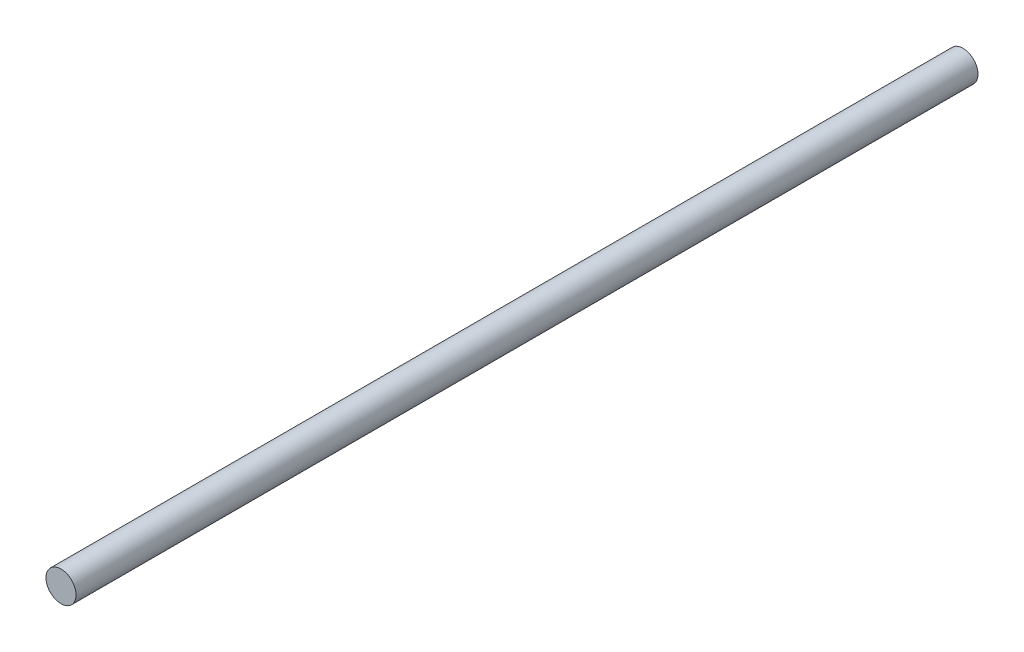
ISO-10303-21;
HEADER;
FILE_DESCRIPTION(('STEP AP214'),'2;1');
FILE_NAME('part.step','',(''),(''),'','','');
FILE_SCHEMA(('AUTOMOTIVE_DESIGN { 1 0 10303 214 1 1 1 1 }'));
ENDSEC;
DATA;
#1=APPLICATION_CONTEXT('core data for automotive mechanical design processes');
#2=APPLICATION_PROTOCOL_DEFINITION('international standard','automotive_design',2000,#1);
#3=PRODUCT_CONTEXT('',#1,'mechanical');
#4=PRODUCT('Part','Part','',(#3));
#5=PRODUCT_RELATED_PRODUCT_CATEGORY('part','',(#4));
#6=PRODUCT_DEFINITION_FORMATION('','',#4);
#7=PRODUCT_DEFINITION_CONTEXT('part definition',#1,'design');
#8=PRODUCT_DEFINITION('design','',#6,#7);
#9=PRODUCT_DEFINITION_SHAPE('','',#8);
#10=(LENGTH_UNIT() NAMED_UNIT(*) SI_UNIT(.MILLI.,.METRE.));
#11=(NAMED_UNIT(*) PLANE_ANGLE_UNIT() SI_UNIT($,.RADIAN.));
#12=(NAMED_UNIT(*) SI_UNIT($,.STERADIAN.) SOLID_ANGLE_UNIT());
#13=UNCERTAINTY_MEASURE_WITH_UNIT(LENGTH_MEASURE(1.E-05),#10,'distance_accuracy_value','');
#14=(GEOMETRIC_REPRESENTATION_CONTEXT(3) GLOBAL_UNCERTAINTY_ASSIGNED_CONTEXT((#13)) GLOBAL_UNIT_ASSIGNED_CONTEXT((#10,
#11,#12)) REPRESENTATION_CONTEXT('',''));
#15=CARTESIAN_POINT('',(0.,0.,0.));
#16=DIRECTION('',(0.,0.,1.));
#17=DIRECTION('',(1.,0.,0.));
#18=AXIS2_PLACEMENT_3D('',#15,#16,#17);
#19=CARTESIAN_POINT('',(0.,0.,180.));
#20=DIRECTION('',(0.,0.,-1.));
#21=DIRECTION('',(-1.,0.,0.));
#22=AXIS2_PLACEMENT_3D('',#19,#20,#21);
#23=CYLINDRICAL_SURFACE('',#22,3.);
#24=CARTESIAN_POINT('',(0.,0.,180.));
#25=DIRECTION('',(0.,0.,1.));
#26=DIRECTION('',(1.,0.,0.));
#27=AXIS2_PLACEMENT_3D('',#24,#25,#26);
#28=CIRCLE('',#27,3.);
#29=CARTESIAN_POINT('',(3.,0.,180.));
#30=VERTEX_POINT('',#29);
#31=EDGE_CURVE('E10',#30,#30,#28,.T.);
#32=ORIENTED_EDGE('',*,*,#31,.F.);
#33=EDGE_LOOP('',(#32));
#34=FACE_BOUND('',#33,.T.);
#35=CARTESIAN_POINT('',(0.,0.,0.));
#36=DIRECTION('',(0.,0.,1.));
#37=DIRECTION('',(1.,0.,0.));
#38=AXIS2_PLACEMENT_3D('',#35,#36,#37);
#39=CIRCLE('',#38,3.);
#40=CARTESIAN_POINT('',(3.,0.,0.));
#41=VERTEX_POINT('',#40);
#42=EDGE_CURVE('E35',#41,#41,#39,.T.);
#43=ORIENTED_EDGE('',*,*,#42,.T.);
#44=EDGE_LOOP('',(#43));
#45=FACE_BOUND('',#44,.T.);
#46=ADVANCED_FACE('F32',(#34,#45),#23,.T.);
#47=CARTESIAN_POINT('',(0.,0.,180.));
#48=DIRECTION('',(0.,0.,1.));
#49=DIRECTION('',(1.,0.,0.));
#50=AXIS2_PLACEMENT_3D('',#47,#48,#49);
#51=PLANE('',#50);
#52=ORIENTED_EDGE('',*,*,#31,.T.);
#53=EDGE_LOOP('',(#52));
#54=FACE_BOUND('',#53,.T.);
#55=ADVANCED_FACE('F47',(#54),#51,.T.);
#56=CARTESIAN_POINT('',(0.,0.,0.));
#57=DIRECTION('',(0.,0.,1.));
#58=DIRECTION('',(1.,0.,0.));
#59=AXIS2_PLACEMENT_3D('',#56,#57,#58);
#60=PLANE('',#59);
#61=ORIENTED_EDGE('',*,*,#42,.F.);
#62=EDGE_LOOP('',(#61));
#63=FACE_BOUND('',#62,.T.);
#64=ADVANCED_FACE('F45',(#63),#60,.F.);
#65=CLOSED_SHELL('',(#46,#55,#64));
#66=MANIFOLD_SOLID_BREP('B2',#65);
#67=ADVANCED_BREP_SHAPE_REPRESENTATION('',(#18,#66),#14);
#68=SHAPE_DEFINITION_REPRESENTATION(#9,#67);
ENDSEC;
END-ISO-10303-21;
